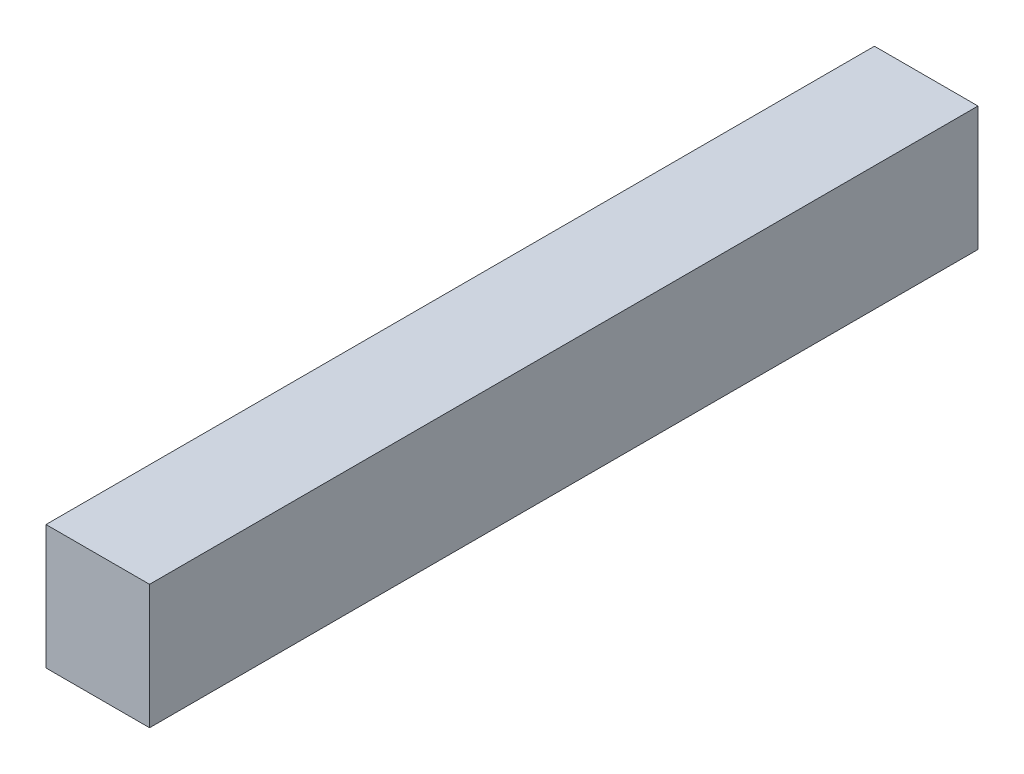
ISO-10303-21;
HEADER;
FILE_DESCRIPTION(('STEP AP214'),'2;1');
FILE_NAME('part.step','',(''),(''),'','','');
FILE_SCHEMA(('AUTOMOTIVE_DESIGN { 1 0 10303 214 1 1 1 1 }'));
ENDSEC;
DATA;
#1=APPLICATION_CONTEXT('core data for automotive mechanical design processes');
#2=APPLICATION_PROTOCOL_DEFINITION('international standard','automotive_design',2000,#1);
#3=PRODUCT_CONTEXT('',#1,'mechanical');
#4=PRODUCT('Part','Part','',(#3));
#5=PRODUCT_RELATED_PRODUCT_CATEGORY('part','',(#4));
#6=PRODUCT_DEFINITION_FORMATION('','',#4);
#7=PRODUCT_DEFINITION_CONTEXT('part definition',#1,'design');
#8=PRODUCT_DEFINITION('design','',#6,#7);
#9=PRODUCT_DEFINITION_SHAPE('','',#8);
#10=(LENGTH_UNIT() NAMED_UNIT(*) SI_UNIT(.MILLI.,.METRE.));
#11=(NAMED_UNIT(*) PLANE_ANGLE_UNIT() SI_UNIT($,.RADIAN.));
#12=(NAMED_UNIT(*) SI_UNIT($,.STERADIAN.) SOLID_ANGLE_UNIT());
#13=UNCERTAINTY_MEASURE_WITH_UNIT(LENGTH_MEASURE(1.E-05),#10,'distance_accuracy_value','');
#14=(GEOMETRIC_REPRESENTATION_CONTEXT(3) GLOBAL_UNCERTAINTY_ASSIGNED_CONTEXT((#13)) GLOBAL_UNIT_ASSIGNED_CONTEXT((#10,
#11,#12)) REPRESENTATION_CONTEXT('',''));
#15=CARTESIAN_POINT('',(0.,0.,0.));
#16=DIRECTION('',(0.,0.,1.));
#17=DIRECTION('',(1.,0.,0.));
#18=AXIS2_PLACEMENT_3D('',#15,#16,#17);
#19=CARTESIAN_POINT('',(12.5,-15.,-100.));
#20=DIRECTION('',(1.,0.,0.));
#21=DIRECTION('',(0.,0.,-1.));
#22=AXIS2_PLACEMENT_3D('',#19,#20,#21);
#23=PLANE('',#22);
#24=DIRECTION('',(0.,0.,1.));
#25=VECTOR('',#24,1.);
#26=CARTESIAN_POINT('',(12.5,15.,-100.));
#27=LINE('',#26,#25);
#28=CARTESIAN_POINT('',(12.5,15.,-100.));
#29=VERTEX_POINT('',#28);
#30=CARTESIAN_POINT('',(12.5,15.,100.));
#31=VERTEX_POINT('',#30);
#32=EDGE_CURVE('E40',#29,#31,#27,.T.);
#33=ORIENTED_EDGE('',*,*,#32,.T.);
#34=DIRECTION('',(0.,1.,0.));
#35=VECTOR('',#34,1.);
#36=CARTESIAN_POINT('',(12.5,-15.,100.));
#37=LINE('',#36,#35);
#38=CARTESIAN_POINT('',(12.5,-15.,100.));
#39=VERTEX_POINT('',#38);
#40=EDGE_CURVE('E77',#39,#31,#37,.T.);
#41=ORIENTED_EDGE('',*,*,#40,.F.);
#42=DIRECTION('',(0.,0.,1.));
#43=VECTOR('',#42,1.);
#44=CARTESIAN_POINT('',(12.5,-15.,-100.));
#45=LINE('',#44,#43);
#46=CARTESIAN_POINT('',(12.5,-15.,-100.));
#47=VERTEX_POINT('',#46);
#48=EDGE_CURVE('E11',#47,#39,#45,.T.);
#49=ORIENTED_EDGE('',*,*,#48,.F.);
#50=DIRECTION('',(0.,1.,0.));
#51=VECTOR('',#50,1.);
#52=CARTESIAN_POINT('',(12.5,-15.,-100.));
#53=LINE('',#52,#51);
#54=EDGE_CURVE('E78',#47,#29,#53,.T.);
#55=ORIENTED_EDGE('',*,*,#54,.T.);
#56=EDGE_LOOP('',(#33,#41,#49,#55));
#57=FACE_BOUND('',#56,.T.);
#58=ADVANCED_FACE('F37',(#57),#23,.T.);
#59=CARTESIAN_POINT('',(-12.5,-15.,-100.));
#60=DIRECTION('',(0.,-1.,0.));
#61=DIRECTION('',(0.,0.,-1.));
#62=AXIS2_PLACEMENT_3D('',#59,#60,#61);
#63=PLANE('',#62);
#64=ORIENTED_EDGE('',*,*,#48,.T.);
#65=DIRECTION('',(1.,0.,0.));
#66=VECTOR('',#65,1.);
#67=CARTESIAN_POINT('',(-12.5,-15.,100.));
#68=LINE('',#67,#66);
#69=CARTESIAN_POINT('',(-12.5,-15.,100.));
#70=VERTEX_POINT('',#69);
#71=EDGE_CURVE('E94',#70,#39,#68,.T.);
#72=ORIENTED_EDGE('',*,*,#71,.F.);
#73=DIRECTION('',(0.,0.,1.));
#74=VECTOR('',#73,1.);
#75=CARTESIAN_POINT('',(-12.5,-15.,-100.));
#76=LINE('',#75,#74);
#77=CARTESIAN_POINT('',(-12.5,-15.,-100.));
#78=VERTEX_POINT('',#77);
#79=EDGE_CURVE('E45',#78,#70,#76,.T.);
#80=ORIENTED_EDGE('',*,*,#79,.F.);
#81=DIRECTION('',(1.,0.,0.));
#82=VECTOR('',#81,1.);
#83=CARTESIAN_POINT('',(-12.5,-15.,-100.));
#84=LINE('',#83,#82);
#85=EDGE_CURVE('E83',#78,#47,#84,.T.);
#86=ORIENTED_EDGE('',*,*,#85,.T.);
#87=EDGE_LOOP('',(#64,#72,#80,#86));
#88=FACE_BOUND('',#87,.T.);
#89=ADVANCED_FACE('F109',(#88),#63,.T.);
#90=CARTESIAN_POINT('',(-12.5,-15.,-100.));
#91=DIRECTION('',(-1.,0.,0.));
#92=DIRECTION('',(0.,0.,1.));
#93=AXIS2_PLACEMENT_3D('',#90,#91,#92);
#94=PLANE('',#93);
#95=ORIENTED_EDGE('',*,*,#79,.T.);
#96=DIRECTION('',(0.,-1.,0.));
#97=VECTOR('',#96,1.);
#98=CARTESIAN_POINT('',(-12.5,-15.,100.));
#99=LINE('',#98,#97);
#100=CARTESIAN_POINT('',(-12.5,15.,100.));
#101=VERTEX_POINT('',#100);
#102=EDGE_CURVE('E90',#101,#70,#99,.T.);
#103=ORIENTED_EDGE('',*,*,#102,.F.);
#104=DIRECTION('',(0.,0.,1.));
#105=VECTOR('',#104,1.);
#106=CARTESIAN_POINT('',(-12.5,15.,-100.));
#107=LINE('',#106,#105);
#108=CARTESIAN_POINT('',(-12.5,15.,-100.));
#109=VERTEX_POINT('',#108);
#110=EDGE_CURVE('E82',#109,#101,#107,.T.);
#111=ORIENTED_EDGE('',*,*,#110,.F.);
#112=DIRECTION('',(0.,-1.,0.));
#113=VECTOR('',#112,1.);
#114=CARTESIAN_POINT('',(-12.5,-15.,-100.));
#115=LINE('',#114,#113);
#116=EDGE_CURVE('E102',#109,#78,#115,.T.);
#117=ORIENTED_EDGE('',*,*,#116,.T.);
#118=EDGE_LOOP('',(#95,#103,#111,#117));
#119=FACE_BOUND('',#118,.T.);
#120=ADVANCED_FACE('F106',(#119),#94,.T.);
#121=CARTESIAN_POINT('',(-12.5,15.,-100.));
#122=DIRECTION('',(0.,1.,0.));
#123=DIRECTION('',(0.,0.,1.));
#124=AXIS2_PLACEMENT_3D('',#121,#122,#123);
#125=PLANE('',#124);
#126=ORIENTED_EDGE('',*,*,#110,.T.);
#127=DIRECTION('',(-1.,0.,0.));
#128=VECTOR('',#127,1.);
#129=CARTESIAN_POINT('',(-12.5,15.,100.));
#130=LINE('',#129,#128);
#131=EDGE_CURVE('E85',#31,#101,#130,.T.);
#132=ORIENTED_EDGE('',*,*,#131,.F.);
#133=ORIENTED_EDGE('',*,*,#32,.F.);
#134=DIRECTION('',(-1.,0.,0.));
#135=VECTOR('',#134,1.);
#136=CARTESIAN_POINT('',(-12.5,15.,-100.));
#137=LINE('',#136,#135);
#138=EDGE_CURVE('E100',#29,#109,#137,.T.);
#139=ORIENTED_EDGE('',*,*,#138,.T.);
#140=EDGE_LOOP('',(#126,#132,#133,#139));
#141=FACE_BOUND('',#140,.T.);
#142=ADVANCED_FACE('F86',(#141),#125,.T.);
#143=CARTESIAN_POINT('',(0.,0.,-100.));
#144=DIRECTION('',(0.,0.,-1.));
#145=DIRECTION('',(-1.,0.,0.));
#146=AXIS2_PLACEMENT_3D('',#143,#144,#145);
#147=PLANE('',#146);
#148=ORIENTED_EDGE('',*,*,#54,.F.);
#149=ORIENTED_EDGE('',*,*,#85,.F.);
#150=ORIENTED_EDGE('',*,*,#116,.F.);
#151=ORIENTED_EDGE('',*,*,#138,.F.);
#152=EDGE_LOOP('',(#148,#149,#150,#151));
#153=FACE_BOUND('',#152,.T.);
#154=ADVANCED_FACE('F111',(#153),#147,.T.);
#155=CARTESIAN_POINT('',(0.,0.,100.));
#156=DIRECTION('',(0.,0.,-1.));
#157=DIRECTION('',(-1.,0.,0.));
#158=AXIS2_PLACEMENT_3D('',#155,#156,#157);
#159=PLANE('',#158);
#160=ORIENTED_EDGE('',*,*,#40,.T.);
#161=ORIENTED_EDGE('',*,*,#131,.T.);
#162=ORIENTED_EDGE('',*,*,#102,.T.);
#163=ORIENTED_EDGE('',*,*,#71,.T.);
#164=EDGE_LOOP('',(#160,#161,#162,#163));
#165=FACE_BOUND('',#164,.T.);
#166=ADVANCED_FACE('F93',(#165),#159,.F.);
#167=CLOSED_SHELL('',(#58,#89,#120,#142,#154,#166));
#168=MANIFOLD_SOLID_BREP('B2',#167);
#169=ADVANCED_BREP_SHAPE_REPRESENTATION('',(#18,#168),#14);
#170=SHAPE_DEFINITION_REPRESENTATION(#9,#169);
ENDSEC;
END-ISO-10303-21;
